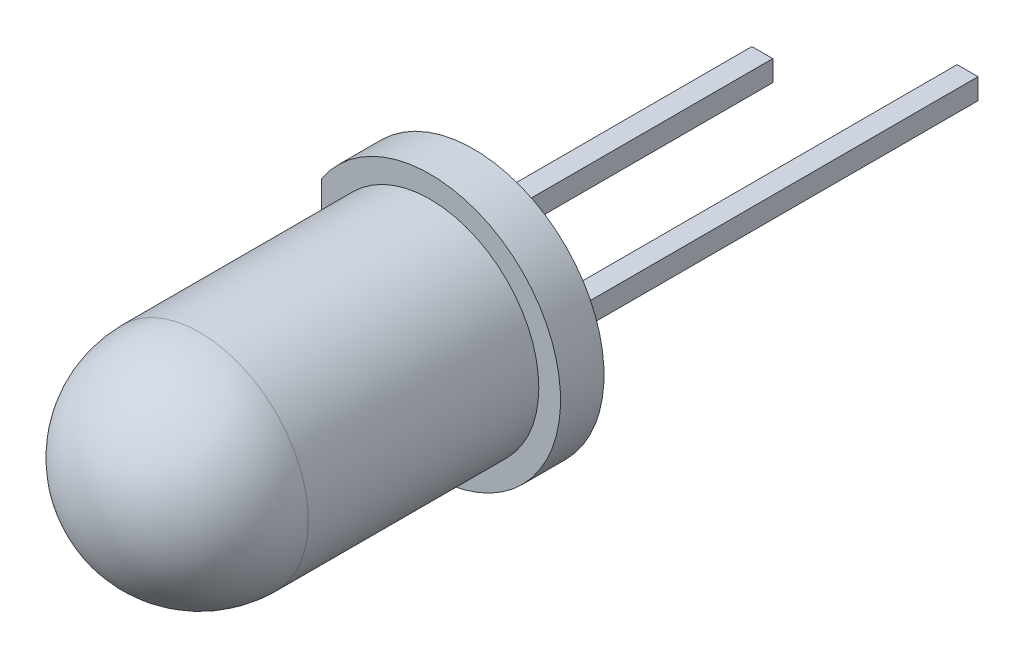
ISO-10303-21;
HEADER;
FILE_DESCRIPTION(('STEP AP214'),'2;1');
FILE_NAME('part.step','',(''),(''),'','','');
FILE_SCHEMA(('AUTOMOTIVE_DESIGN { 1 0 10303 214 1 1 1 1 }'));
ENDSEC;
DATA;
#1=APPLICATION_CONTEXT('core data for automotive mechanical design processes');
#2=APPLICATION_PROTOCOL_DEFINITION('international standard','automotive_design',2000,#1);
#3=PRODUCT_CONTEXT('',#1,'mechanical');
#4=PRODUCT('Part','Part','',(#3));
#5=PRODUCT_RELATED_PRODUCT_CATEGORY('part','',(#4));
#6=PRODUCT_DEFINITION_FORMATION('','',#4);
#7=PRODUCT_DEFINITION_CONTEXT('part definition',#1,'design');
#8=PRODUCT_DEFINITION('design','',#6,#7);
#9=PRODUCT_DEFINITION_SHAPE('','',#8);
#10=(LENGTH_UNIT() NAMED_UNIT(*) SI_UNIT(.MILLI.,.METRE.));
#11=(NAMED_UNIT(*) PLANE_ANGLE_UNIT() SI_UNIT($,.RADIAN.));
#12=(NAMED_UNIT(*) SI_UNIT($,.STERADIAN.) SOLID_ANGLE_UNIT());
#13=UNCERTAINTY_MEASURE_WITH_UNIT(LENGTH_MEASURE(1.E-05),#10,'distance_accuracy_value','');
#14=(GEOMETRIC_REPRESENTATION_CONTEXT(3) GLOBAL_UNCERTAINTY_ASSIGNED_CONTEXT((#13)) GLOBAL_UNIT_ASSIGNED_CONTEXT((#10,
#11,#12)) REPRESENTATION_CONTEXT('',''));
#15=CARTESIAN_POINT('',(0.,0.,0.));
#16=DIRECTION('',(0.,0.,1.));
#17=DIRECTION('',(1.,0.,0.));
#18=AXIS2_PLACEMENT_3D('',#15,#16,#17);
#19=CARTESIAN_POINT('',(-0.0499999999999997,0.,4.26666666666667));
#20=DIRECTION('',(0.,0.,1.));
#21=DIRECTION('',(-1.,0.,0.));
#22=AXIS2_PLACEMENT_3D('',#19,#20,#21);
#23=SPHERICAL_SURFACE('',#22,0.566666666666667);
#24=CARTESIAN_POINT('',(-0.0499999999999997,-0.24,4.26666666666667));
#25=DIRECTION('',(0.,1.,0.));
#26=DIRECTION('',(0.,0.,1.));
#27=AXIS2_PLACEMENT_3D('',#24,#25,#26);
#28=CIRCLE('',#27,0.513333333333333);
#29=CARTESIAN_POINT('',(-0.488634243989226,-0.24,4.));
#30=VERTEX_POINT('',#29);
#31=CARTESIAN_POINT('',(0.388634243989226,-0.24,4.));
#32=VERTEX_POINT('',#31);
#33=EDGE_CURVE('E167',#30,#32,#28,.F.);
#34=ORIENTED_EDGE('',*,*,#33,.T.);
#35=CARTESIAN_POINT('',(-0.0499999999999997,0.,4.));
#36=DIRECTION('',(0.,0.,1.));
#37=DIRECTION('',(1.,0.,0.));
#38=AXIS2_PLACEMENT_3D('',#35,#36,#37);
#39=CIRCLE('',#38,0.5);
#40=EDGE_CURVE('E62',#30,#32,#39,.T.);
#41=ORIENTED_EDGE('',*,*,#40,.F.);
#42=EDGE_LOOP('',(#34,#41));
#43=FACE_BOUND('',#42,.T.);
#44=ADVANCED_FACE('F54',(#43),#23,.T.);
#45=CARTESIAN_POINT('',(0.388634243989226,0.24,4.));
#46=VERTEX_POINT('',#45);
#47=CARTESIAN_POINT('',(-0.488634243989226,0.24,4.));
#48=VERTEX_POINT('',#47);
#49=EDGE_CURVE('E12',#46,#48,#39,.T.);
#50=ORIENTED_EDGE('',*,*,#49,.F.);
#51=CARTESIAN_POINT('',(-0.0499999999999997,0.24,4.26666666666667));
#52=DIRECTION('',(0.,1.,0.));
#53=DIRECTION('',(0.,0.,1.));
#54=AXIS2_PLACEMENT_3D('',#51,#52,#53);
#55=CIRCLE('',#54,0.513333333333333);
#56=EDGE_CURVE('E189',#48,#46,#55,.F.);
#57=ORIENTED_EDGE('',*,*,#56,.F.);
#58=EDGE_LOOP('',(#50,#57));
#59=FACE_BOUND('',#58,.T.);
#60=ADVANCED_FACE('F56',(#59),#23,.T.);
#61=CARTESIAN_POINT('',(-0.55,0.,4.));
#62=DIRECTION('',(0.,0.,-1.));
#63=DIRECTION('',(-1.,0.,0.));
#64=AXIS2_PLACEMENT_3D('',#61,#62,#63);
#65=PLANE('',#64);
#66=CARTESIAN_POINT('',(-0.0499999999999997,0.,4.));
#67=DIRECTION('',(0.,0.,1.));
#68=DIRECTION('',(1.,0.,0.));
#69=AXIS2_PLACEMENT_3D('',#66,#67,#68);
#70=CIRCLE('',#69,0.2);
#71=CARTESIAN_POINT('',(0.15,0.,4.));
#72=VERTEX_POINT('',#71);
#73=EDGE_CURVE('E262',#72,#72,#70,.T.);
#74=ORIENTED_EDGE('',*,*,#73,.F.);
#75=EDGE_LOOP('',(#74));
#76=FACE_BOUND('',#75,.T.);
#77=ORIENTED_EDGE('',*,*,#49,.T.);
#78=DIRECTION('',(1.,0.,0.));
#79=VECTOR('',#78,1.);
#80=CARTESIAN_POINT('',(-1.3,0.24,4.));
#81=LINE('',#80,#79);
#82=CARTESIAN_POINT('',(-1.3,0.24,4.));
#83=VERTEX_POINT('',#82);
#84=EDGE_CURVE('E108',#83,#48,#81,.T.);
#85=ORIENTED_EDGE('',*,*,#84,.F.);
#86=DIRECTION('',(0.,-1.,0.));
#87=VECTOR('',#86,1.);
#88=CARTESIAN_POINT('',(-1.3,0.24,4.));
#89=LINE('',#88,#87);
#90=CARTESIAN_POINT('',(-1.3,-0.24,4.));
#91=VERTEX_POINT('',#90);
#92=EDGE_CURVE('E166',#83,#91,#89,.T.);
#93=ORIENTED_EDGE('',*,*,#92,.T.);
#94=DIRECTION('',(1.,0.,0.));
#95=VECTOR('',#94,1.);
#96=CARTESIAN_POINT('',(-1.3,-0.24,4.));
#97=LINE('',#96,#95);
#98=EDGE_CURVE('E69',#91,#30,#97,.T.);
#99=ORIENTED_EDGE('',*,*,#98,.T.);
#100=ORIENTED_EDGE('',*,*,#40,.T.);
#101=CARTESIAN_POINT('',(1.2,-0.24,4.));
#102=VERTEX_POINT('',#101);
#103=EDGE_CURVE('E152',#32,#102,#97,.T.);
#104=ORIENTED_EDGE('',*,*,#103,.T.);
#105=DIRECTION('',(0.,-1.,0.));
#106=VECTOR('',#105,1.);
#107=CARTESIAN_POINT('',(1.2,0.24,4.));
#108=LINE('',#107,#106);
#109=CARTESIAN_POINT('',(1.2,0.24,4.));
#110=VERTEX_POINT('',#109);
#111=EDGE_CURVE('E136',#110,#102,#108,.T.);
#112=ORIENTED_EDGE('',*,*,#111,.F.);
#113=EDGE_CURVE('E124',#46,#110,#81,.T.);
#114=ORIENTED_EDGE('',*,*,#113,.F.);
#115=EDGE_LOOP('',(#77,#85,#93,#99,#100,#104,#112,#114));
#116=FACE_BOUND('',#115,.T.);
#117=ADVANCED_FACE('F172',(#76,#116),#65,.F.);
#118=CARTESIAN_POINT('',(0.,0.24,0.));
#119=DIRECTION('',(0.,1.,0.));
#120=DIRECTION('',(0.,0.,1.));
#121=AXIS2_PLACEMENT_3D('',#118,#119,#120);
#122=PLANE('',#121);
#123=ORIENTED_EDGE('',*,*,#84,.T.);
#124=ORIENTED_EDGE('',*,*,#56,.T.);
#125=ORIENTED_EDGE('',*,*,#113,.T.);
#126=DIRECTION('',(-0.508148861978286,0.,-0.861269257590315));
#127=VECTOR('',#126,1.);
#128=CARTESIAN_POINT('',(1.2,0.24,4.));
#129=LINE('',#128,#127);
#130=CARTESIAN_POINT('',(0.0199999999999998,0.24,2.));
#131=VERTEX_POINT('',#130);
#132=EDGE_CURVE('E115',#110,#131,#129,.T.);
#133=ORIENTED_EDGE('',*,*,#132,.T.);
#134=DIRECTION('',(-1.,0.,0.));
#135=VECTOR('',#134,1.);
#136=CARTESIAN_POINT('',(0.0199999999999998,0.24,2.));
#137=LINE('',#136,#135);
#138=CARTESIAN_POINT('',(-1.12,0.24,2.));
#139=VERTEX_POINT('',#138);
#140=EDGE_CURVE('E120',#131,#139,#137,.T.);
#141=ORIENTED_EDGE('',*,*,#140,.T.);
#142=DIRECTION('',(0.,0.,-1.));
#143=VECTOR('',#142,1.);
#144=CARTESIAN_POINT('',(-1.12,0.24,2.));
#145=LINE('',#144,#143);
#146=CARTESIAN_POINT('',(-1.12,0.24,-8.));
#147=VERTEX_POINT('',#146);
#148=EDGE_CURVE('E142',#139,#147,#145,.T.);
#149=ORIENTED_EDGE('',*,*,#148,.T.);
#150=DIRECTION('',(1.,0.,0.));
#151=VECTOR('',#150,1.);
#152=CARTESIAN_POINT('',(-1.12,0.24,-8.));
#153=LINE('',#152,#151);
#154=CARTESIAN_POINT('',(-1.6,0.24,-8.));
#155=VERTEX_POINT('',#154);
#156=EDGE_CURVE('E153',#155,#147,#153,.T.);
#157=ORIENTED_EDGE('',*,*,#156,.F.);
#158=DIRECTION('',(0.,0.,1.));
#159=VECTOR('',#158,1.);
#160=CARTESIAN_POINT('',(-1.6,0.24,0.));
#161=LINE('',#160,#159);
#162=CARTESIAN_POINT('',(-1.6,0.24,3.5));
#163=VERTEX_POINT('',#162);
#164=EDGE_CURVE('E78',#155,#163,#161,.T.);
#165=ORIENTED_EDGE('',*,*,#164,.T.);
#166=DIRECTION('',(0.514495755427526,0.,0.857492925712544));
#167=VECTOR('',#166,1.);
#168=CARTESIAN_POINT('',(-1.6,0.24,3.5));
#169=LINE('',#168,#167);
#170=EDGE_CURVE('E162',#163,#83,#169,.T.);
#171=ORIENTED_EDGE('',*,*,#170,.T.);
#172=EDGE_LOOP('',(#123,#124,#125,#133,#141,#149,#157,#165,#171));
#173=FACE_BOUND('',#172,.T.);
#174=ADVANCED_FACE('F117',(#173),#122,.T.);
#175=CARTESIAN_POINT('',(0.,-0.24,0.));
#176=DIRECTION('',(0.,1.,0.));
#177=DIRECTION('',(0.,0.,1.));
#178=AXIS2_PLACEMENT_3D('',#175,#176,#177);
#179=PLANE('',#178);
#180=ORIENTED_EDGE('',*,*,#33,.F.);
#181=ORIENTED_EDGE('',*,*,#98,.F.);
#182=DIRECTION('',(0.514495755427526,0.,0.857492925712544));
#183=VECTOR('',#182,1.);
#184=CARTESIAN_POINT('',(-1.6,-0.24,3.5));
#185=LINE('',#184,#183);
#186=CARTESIAN_POINT('',(-1.6,-0.24,3.5));
#187=VERTEX_POINT('',#186);
#188=EDGE_CURVE('E149',#187,#91,#185,.T.);
#189=ORIENTED_EDGE('',*,*,#188,.F.);
#190=DIRECTION('',(0.,0.,1.));
#191=VECTOR('',#190,1.);
#192=CARTESIAN_POINT('',(-1.6,-0.24,0.));
#193=LINE('',#192,#191);
#194=CARTESIAN_POINT('',(-1.6,-0.24,-8.));
#195=VERTEX_POINT('',#194);
#196=EDGE_CURVE('E102',#195,#187,#193,.T.);
#197=ORIENTED_EDGE('',*,*,#196,.F.);
#198=DIRECTION('',(-1.,0.,0.));
#199=VECTOR('',#198,1.);
#200=CARTESIAN_POINT('',(-1.12,-0.24,-8.));
#201=LINE('',#200,#199);
#202=CARTESIAN_POINT('',(-1.12,-0.24,-8.));
#203=VERTEX_POINT('',#202);
#204=EDGE_CURVE('E210',#203,#195,#201,.T.);
#205=ORIENTED_EDGE('',*,*,#204,.F.);
#206=DIRECTION('',(0.,0.,-1.));
#207=VECTOR('',#206,1.);
#208=CARTESIAN_POINT('',(-1.12,-0.24,2.));
#209=LINE('',#208,#207);
#210=CARTESIAN_POINT('',(-1.12,-0.24,2.));
#211=VERTEX_POINT('',#210);
#212=EDGE_CURVE('E158',#211,#203,#209,.T.);
#213=ORIENTED_EDGE('',*,*,#212,.F.);
#214=DIRECTION('',(-1.,0.,0.));
#215=VECTOR('',#214,1.);
#216=CARTESIAN_POINT('',(0.0199999999999998,-0.24,2.));
#217=LINE('',#216,#215);
#218=CARTESIAN_POINT('',(0.0199999999999998,-0.24,2.));
#219=VERTEX_POINT('',#218);
#220=EDGE_CURVE('E156',#219,#211,#217,.T.);
#221=ORIENTED_EDGE('',*,*,#220,.F.);
#222=DIRECTION('',(-0.508148861978286,0.,-0.861269257590315));
#223=VECTOR('',#222,1.);
#224=CARTESIAN_POINT('',(1.2,-0.24,4.));
#225=LINE('',#224,#223);
#226=EDGE_CURVE('E133',#102,#219,#225,.T.);
#227=ORIENTED_EDGE('',*,*,#226,.F.);
#228=ORIENTED_EDGE('',*,*,#103,.F.);
#229=EDGE_LOOP('',(#180,#181,#189,#197,#205,#213,#221,#227,#228));
#230=FACE_BOUND('',#229,.T.);
#231=ADVANCED_FACE('F224',(#230),#179,.F.);
#232=CARTESIAN_POINT('',(-1.6,0.24,3.5));
#233=DIRECTION('',(0.857492925712544,0.,-0.514495755427526));
#234=DIRECTION('',(-0.514495755427526,0.,-0.857492925712544));
#235=AXIS2_PLACEMENT_3D('',#232,#233,#234);
#236=PLANE('',#235);
#237=ORIENTED_EDGE('',*,*,#188,.T.);
#238=ORIENTED_EDGE('',*,*,#92,.F.);
#239=ORIENTED_EDGE('',*,*,#170,.F.);
#240=DIRECTION('',(0.,-1.,0.));
#241=VECTOR('',#240,1.);
#242=CARTESIAN_POINT('',(-1.6,0.24,3.5));
#243=LINE('',#242,#241);
#244=EDGE_CURVE('E148',#163,#187,#243,.T.);
#245=ORIENTED_EDGE('',*,*,#244,.T.);
#246=EDGE_LOOP('',(#237,#238,#239,#245));
#247=FACE_BOUND('',#246,.T.);
#248=ADVANCED_FACE('F221',(#247),#236,.F.);
#249=CARTESIAN_POINT('',(1.2,0.24,4.));
#250=DIRECTION('',(-0.861269257590315,0.,0.508148861978286));
#251=DIRECTION('',(0.508148861978286,0.,0.861269257590315));
#252=AXIS2_PLACEMENT_3D('',#249,#250,#251);
#253=PLANE('',#252);
#254=ORIENTED_EDGE('',*,*,#226,.T.);
#255=DIRECTION('',(0.,-1.,0.));
#256=VECTOR('',#255,1.);
#257=CARTESIAN_POINT('',(0.0199999999999998,0.24,2.));
#258=LINE('',#257,#256);
#259=EDGE_CURVE('E130',#131,#219,#258,.T.);
#260=ORIENTED_EDGE('',*,*,#259,.F.);
#261=ORIENTED_EDGE('',*,*,#132,.F.);
#262=ORIENTED_EDGE('',*,*,#111,.T.);
#263=EDGE_LOOP('',(#254,#260,#261,#262));
#264=FACE_BOUND('',#263,.T.);
#265=ADVANCED_FACE('F131',(#264),#253,.F.);
#266=CARTESIAN_POINT('',(0.0199999999999998,0.24,2.));
#267=DIRECTION('',(0.,0.,1.));
#268=DIRECTION('',(1.,0.,0.));
#269=AXIS2_PLACEMENT_3D('',#266,#267,#268);
#270=PLANE('',#269);
#271=ORIENTED_EDGE('',*,*,#220,.T.);
#272=DIRECTION('',(0.,-1.,0.));
#273=VECTOR('',#272,1.);
#274=CARTESIAN_POINT('',(-1.12,0.24,2.));
#275=LINE('',#274,#273);
#276=EDGE_CURVE('E137',#139,#211,#275,.T.);
#277=ORIENTED_EDGE('',*,*,#276,.F.);
#278=ORIENTED_EDGE('',*,*,#140,.F.);
#279=ORIENTED_EDGE('',*,*,#259,.T.);
#280=EDGE_LOOP('',(#271,#277,#278,#279));
#281=FACE_BOUND('',#280,.T.);
#282=ADVANCED_FACE('F139',(#281),#270,.F.);
#283=CARTESIAN_POINT('',(-1.12,0.24,2.));
#284=DIRECTION('',(-1.,0.,0.));
#285=DIRECTION('',(0.,0.,1.));
#286=AXIS2_PLACEMENT_3D('',#283,#284,#285);
#287=PLANE('',#286);
#288=ORIENTED_EDGE('',*,*,#212,.T.);
#289=DIRECTION('',(0.,-1.,0.));
#290=VECTOR('',#289,1.);
#291=CARTESIAN_POINT('',(-1.12,-0.24,-8.));
#292=LINE('',#291,#290);
#293=EDGE_CURVE('E204',#147,#203,#292,.T.);
#294=ORIENTED_EDGE('',*,*,#293,.F.);
#295=ORIENTED_EDGE('',*,*,#148,.F.);
#296=ORIENTED_EDGE('',*,*,#276,.T.);
#297=EDGE_LOOP('',(#288,#294,#295,#296));
#298=FACE_BOUND('',#297,.T.);
#299=ADVANCED_FACE('F207',(#298),#287,.F.);
#300=CARTESIAN_POINT('',(-1.6,0.24,0.));
#301=DIRECTION('',(1.,0.,0.));
#302=DIRECTION('',(0.,0.,-1.));
#303=AXIS2_PLACEMENT_3D('',#300,#301,#302);
#304=PLANE('',#303);
#305=ORIENTED_EDGE('',*,*,#196,.T.);
#306=ORIENTED_EDGE('',*,*,#244,.F.);
#307=ORIENTED_EDGE('',*,*,#164,.F.);
#308=DIRECTION('',(0.,1.,0.));
#309=VECTOR('',#308,1.);
#310=CARTESIAN_POINT('',(-1.6,-0.24,-8.));
#311=LINE('',#310,#309);
#312=EDGE_CURVE('E205',#195,#155,#311,.T.);
#313=ORIENTED_EDGE('',*,*,#312,.F.);
#314=EDGE_LOOP('',(#305,#306,#307,#313));
#315=FACE_BOUND('',#314,.T.);
#316=ADVANCED_FACE('F225',(#315),#304,.F.);
#317=CARTESIAN_POINT('',(0.,0.,-8.));
#318=DIRECTION('',(0.,0.,1.));
#319=DIRECTION('',(1.,0.,0.));
#320=AXIS2_PLACEMENT_3D('',#317,#318,#319);
#321=PLANE('',#320);
#322=ORIENTED_EDGE('',*,*,#293,.T.);
#323=ORIENTED_EDGE('',*,*,#204,.T.);
#324=ORIENTED_EDGE('',*,*,#312,.T.);
#325=ORIENTED_EDGE('',*,*,#156,.T.);
#326=EDGE_LOOP('',(#322,#323,#324,#325));
#327=FACE_BOUND('',#326,.T.);
#328=ADVANCED_FACE('F202',(#327),#321,.F.);
#329=CARTESIAN_POINT('',(-0.0499999999999997,0.,3.9));
#330=DIRECTION('',(0.,0.,1.));
#331=DIRECTION('',(1.,0.,0.));
#332=AXIS2_PLACEMENT_3D('',#329,#330,#331);
#333=CYLINDRICAL_SURFACE('',#332,0.2);
#334=CARTESIAN_POINT('',(-0.0499999999999997,0.,3.9));
#335=DIRECTION('',(0.,0.,1.));
#336=DIRECTION('',(1.,0.,0.));
#337=AXIS2_PLACEMENT_3D('',#334,#335,#336);
#338=CIRCLE('',#337,0.2);
#339=CARTESIAN_POINT('',(0.15,0.,3.9));
#340=VERTEX_POINT('',#339);
#341=EDGE_CURVE('E213',#340,#340,#338,.T.);
#342=ORIENTED_EDGE('',*,*,#341,.F.);
#343=EDGE_LOOP('',(#342));
#344=FACE_BOUND('',#343,.T.);
#345=ORIENTED_EDGE('',*,*,#73,.T.);
#346=EDGE_LOOP('',(#345));
#347=FACE_BOUND('',#346,.T.);
#348=ADVANCED_FACE('F232',(#344,#347),#333,.F.);
#349=CARTESIAN_POINT('',(-0.0499999999999997,0.,3.9));
#350=DIRECTION('',(0.,0.,1.));
#351=DIRECTION('',(1.,0.,0.));
#352=AXIS2_PLACEMENT_3D('',#349,#350,#351);
#353=PLANE('',#352);
#354=ORIENTED_EDGE('',*,*,#341,.T.);
#355=EDGE_LOOP('',(#354));
#356=FACE_BOUND('',#355,.T.);
#357=ADVANCED_FACE('F254',(#356),#353,.T.);
#358=CLOSED_SHELL('',(#44,#60,#117,#174,#231,#248,#265,#282,#299,#316,#328,#348,#357));
#359=MANIFOLD_SOLID_BREP('B2',#358);
#360=CARTESIAN_POINT('',(1.12,0.24,2.));
#361=DIRECTION('',(0.,0.,1.));
#362=DIRECTION('',(1.,0.,0.));
#363=AXIS2_PLACEMENT_3D('',#360,#361,#362);
#364=PLANE('',#363);
#365=DIRECTION('',(-1.,0.,0.));
#366=VECTOR('',#365,1.);
#367=CARTESIAN_POINT('',(1.12,-0.24,2.));
#368=LINE('',#367,#366);
#369=CARTESIAN_POINT('',(1.12,-0.24,2.));
#370=VERTEX_POINT('',#369);
#371=CARTESIAN_POINT('',(0.22,-0.24,2.));
#372=VERTEX_POINT('',#371);
#373=EDGE_CURVE('E460',#370,#372,#368,.T.);
#374=ORIENTED_EDGE('',*,*,#373,.T.);
#375=DIRECTION('',(0.,-1.,0.));
#376=VECTOR('',#375,1.);
#377=CARTESIAN_POINT('',(0.22,0.24,2.));
#378=LINE('',#377,#376);
#379=CARTESIAN_POINT('',(0.22,0.24,2.));
#380=VERTEX_POINT('',#379);
#381=EDGE_CURVE('E52',#380,#372,#378,.T.);
#382=ORIENTED_EDGE('',*,*,#381,.F.);
#383=DIRECTION('',(-1.,0.,0.));
#384=VECTOR('',#383,1.);
#385=CARTESIAN_POINT('',(1.12,0.24,2.));
#386=LINE('',#385,#384);
#387=CARTESIAN_POINT('',(1.12,0.24,2.));
#388=VERTEX_POINT('',#387);
#389=EDGE_CURVE('E461',#388,#380,#386,.T.);
#390=ORIENTED_EDGE('',*,*,#389,.F.);
#391=DIRECTION('',(0.,-1.,0.));
#392=VECTOR('',#391,1.);
#393=CARTESIAN_POINT('',(1.12,0.24,2.));
#394=LINE('',#393,#392);
#395=EDGE_CURVE('E466',#388,#370,#394,.T.);
#396=ORIENTED_EDGE('',*,*,#395,.T.);
#397=EDGE_LOOP('',(#374,#382,#390,#396));
#398=FACE_BOUND('',#397,.T.);
#399=ADVANCED_FACE('F374',(#398),#364,.F.);
#400=CARTESIAN_POINT('',(0.22,0.24,2.));
#401=DIRECTION('',(0.861269257590315,0.,-0.508148861978286));
#402=DIRECTION('',(-0.508148861978286,0.,-0.861269257590315));
#403=AXIS2_PLACEMENT_3D('',#400,#401,#402);
#404=PLANE('',#403);
#405=DIRECTION('',(0.508148861978286,0.,0.861269257590315));
#406=VECTOR('',#405,1.);
#407=CARTESIAN_POINT('',(0.22,-0.24,2.));
#408=LINE('',#407,#406);
#409=CARTESIAN_POINT('',(1.4,-0.24,4.));
#410=VERTEX_POINT('',#409);
#411=EDGE_CURVE('E469',#372,#410,#408,.T.);
#412=ORIENTED_EDGE('',*,*,#411,.T.);
#413=DIRECTION('',(0.,-1.,0.));
#414=VECTOR('',#413,1.);
#415=CARTESIAN_POINT('',(1.4,0.24,4.));
#416=LINE('',#415,#414);
#417=CARTESIAN_POINT('',(1.4,0.24,4.));
#418=VERTEX_POINT('',#417);
#419=EDGE_CURVE('E382',#418,#410,#416,.T.);
#420=ORIENTED_EDGE('',*,*,#419,.F.);
#421=DIRECTION('',(0.508148861978286,0.,0.861269257590315));
#422=VECTOR('',#421,1.);
#423=CARTESIAN_POINT('',(0.22,0.24,2.));
#424=LINE('',#423,#422);
#425=EDGE_CURVE('E423',#380,#418,#424,.T.);
#426=ORIENTED_EDGE('',*,*,#425,.F.);
#427=ORIENTED_EDGE('',*,*,#381,.T.);
#428=EDGE_LOOP('',(#412,#420,#426,#427));
#429=FACE_BOUND('',#428,.T.);
#430=ADVANCED_FACE('F484',(#429),#404,.F.);
#431=CARTESIAN_POINT('',(1.4,0.24,4.));
#432=DIRECTION('',(0.,0.,-1.));
#433=DIRECTION('',(-1.,0.,0.));
#434=AXIS2_PLACEMENT_3D('',#431,#432,#433);
#435=PLANE('',#434);
#436=DIRECTION('',(1.,0.,0.));
#437=VECTOR('',#436,1.);
#438=CARTESIAN_POINT('',(1.4,-0.24,4.));
#439=LINE('',#438,#437);
#440=CARTESIAN_POINT('',(1.6,-0.24,4.));
#441=VERTEX_POINT('',#440);
#442=EDGE_CURVE('E409',#410,#441,#439,.T.);
#443=ORIENTED_EDGE('',*,*,#442,.T.);
#444=DIRECTION('',(0.,-1.,0.));
#445=VECTOR('',#444,1.);
#446=CARTESIAN_POINT('',(1.6,0.24,4.));
#447=LINE('',#446,#445);
#448=CARTESIAN_POINT('',(1.6,0.24,4.));
#449=VERTEX_POINT('',#448);
#450=EDGE_CURVE('E475',#449,#441,#447,.T.);
#451=ORIENTED_EDGE('',*,*,#450,.F.);
#452=DIRECTION('',(1.,0.,0.));
#453=VECTOR('',#452,1.);
#454=CARTESIAN_POINT('',(1.4,0.24,4.));
#455=LINE('',#454,#453);
#456=EDGE_CURVE('E440',#418,#449,#455,.T.);
#457=ORIENTED_EDGE('',*,*,#456,.F.);
#458=ORIENTED_EDGE('',*,*,#419,.T.);
#459=EDGE_LOOP('',(#443,#451,#457,#458));
#460=FACE_BOUND('',#459,.T.);
#461=ADVANCED_FACE('F476',(#460),#435,.F.);
#462=CARTESIAN_POINT('',(1.6,0.24,4.));
#463=DIRECTION('',(-1.,0.,0.));
#464=DIRECTION('',(0.,0.,1.));
#465=AXIS2_PLACEMENT_3D('',#462,#463,#464);
#466=PLANE('',#465);
#467=DIRECTION('',(0.,0.,-1.));
#468=VECTOR('',#467,1.);
#469=CARTESIAN_POINT('',(1.6,-0.24,4.));
#470=LINE('',#469,#468);
#471=CARTESIAN_POINT('',(1.6,-0.24,-10.));
#472=VERTEX_POINT('',#471);
#473=EDGE_CURVE('E447',#441,#472,#470,.T.);
#474=ORIENTED_EDGE('',*,*,#473,.T.);
#475=DIRECTION('',(0.,-1.,0.));
#476=VECTOR('',#475,1.);
#477=CARTESIAN_POINT('',(1.6,0.24,-10.));
#478=LINE('',#477,#476);
#479=CARTESIAN_POINT('',(1.6,0.24,-10.));
#480=VERTEX_POINT('',#479);
#481=EDGE_CURVE('E444',#480,#472,#478,.T.);
#482=ORIENTED_EDGE('',*,*,#481,.F.);
#483=DIRECTION('',(0.,0.,-1.));
#484=VECTOR('',#483,1.);
#485=CARTESIAN_POINT('',(1.6,0.24,4.));
#486=LINE('',#485,#484);
#487=EDGE_CURVE('E434',#449,#480,#486,.T.);
#488=ORIENTED_EDGE('',*,*,#487,.F.);
#489=ORIENTED_EDGE('',*,*,#450,.T.);
#490=EDGE_LOOP('',(#474,#482,#488,#489));
#491=FACE_BOUND('',#490,.T.);
#492=ADVANCED_FACE('F445',(#491),#466,.F.);
#493=CARTESIAN_POINT('',(1.12,0.24,0.));
#494=DIRECTION('',(1.,0.,0.));
#495=DIRECTION('',(0.,0.,-1.));
#496=AXIS2_PLACEMENT_3D('',#493,#494,#495);
#497=PLANE('',#496);
#498=DIRECTION('',(0.,0.,1.));
#499=VECTOR('',#498,1.);
#500=CARTESIAN_POINT('',(1.12,-0.24,0.));
#501=LINE('',#500,#499);
#502=CARTESIAN_POINT('',(1.12,-0.24,-10.));
#503=VERTEX_POINT('',#502);
#504=EDGE_CURVE('E416',#503,#370,#501,.T.);
#505=ORIENTED_EDGE('',*,*,#504,.T.);
#506=ORIENTED_EDGE('',*,*,#395,.F.);
#507=DIRECTION('',(0.,0.,1.));
#508=VECTOR('',#507,1.);
#509=CARTESIAN_POINT('',(1.12,0.24,0.));
#510=LINE('',#509,#508);
#511=CARTESIAN_POINT('',(1.12,0.24,-10.));
#512=VERTEX_POINT('',#511);
#513=EDGE_CURVE('E390',#512,#388,#510,.T.);
#514=ORIENTED_EDGE('',*,*,#513,.F.);
#515=DIRECTION('',(0.,1.,0.));
#516=VECTOR('',#515,1.);
#517=CARTESIAN_POINT('',(1.12,-0.24,-10.));
#518=LINE('',#517,#516);
#519=EDGE_CURVE('E455',#503,#512,#518,.T.);
#520=ORIENTED_EDGE('',*,*,#519,.F.);
#521=EDGE_LOOP('',(#505,#506,#514,#520));
#522=FACE_BOUND('',#521,.T.);
#523=ADVANCED_FACE('F480',(#522),#497,.F.);
#524=CARTESIAN_POINT('',(0.,0.24,0.));
#525=DIRECTION('',(0.,-1.,0.));
#526=DIRECTION('',(0.,0.,-1.));
#527=AXIS2_PLACEMENT_3D('',#524,#525,#526);
#528=PLANE('',#527);
#529=ORIENTED_EDGE('',*,*,#389,.T.);
#530=ORIENTED_EDGE('',*,*,#425,.T.);
#531=ORIENTED_EDGE('',*,*,#456,.T.);
#532=ORIENTED_EDGE('',*,*,#487,.T.);
#533=DIRECTION('',(1.,0.,0.));
#534=VECTOR('',#533,1.);
#535=CARTESIAN_POINT('',(1.12,0.24,-10.));
#536=LINE('',#535,#534);
#537=EDGE_CURVE('E438',#512,#480,#536,.T.);
#538=ORIENTED_EDGE('',*,*,#537,.F.);
#539=ORIENTED_EDGE('',*,*,#513,.T.);
#540=EDGE_LOOP('',(#529,#530,#531,#532,#538,#539));
#541=FACE_BOUND('',#540,.T.);
#542=ADVANCED_FACE('F436',(#541),#528,.F.);
#543=CARTESIAN_POINT('',(0.,-0.24,0.));
#544=DIRECTION('',(0.,-1.,0.));
#545=DIRECTION('',(0.,0.,-1.));
#546=AXIS2_PLACEMENT_3D('',#543,#544,#545);
#547=PLANE('',#546);
#548=ORIENTED_EDGE('',*,*,#373,.F.);
#549=ORIENTED_EDGE('',*,*,#504,.F.);
#550=DIRECTION('',(-1.,0.,0.));
#551=VECTOR('',#550,1.);
#552=CARTESIAN_POINT('',(1.6,-0.24,-10.));
#553=LINE('',#552,#551);
#554=EDGE_CURVE('E451',#472,#503,#553,.T.);
#555=ORIENTED_EDGE('',*,*,#554,.F.);
#556=ORIENTED_EDGE('',*,*,#473,.F.);
#557=ORIENTED_EDGE('',*,*,#442,.F.);
#558=ORIENTED_EDGE('',*,*,#411,.F.);
#559=EDGE_LOOP('',(#548,#549,#555,#556,#557,#558));
#560=FACE_BOUND('',#559,.T.);
#561=ADVANCED_FACE('F479',(#560),#547,.T.);
#562=CARTESIAN_POINT('',(0.,0.,-10.));
#563=DIRECTION('',(0.,0.,-1.));
#564=DIRECTION('',(-1.,0.,0.));
#565=AXIS2_PLACEMENT_3D('',#562,#563,#564);
#566=PLANE('',#565);
#567=ORIENTED_EDGE('',*,*,#537,.T.);
#568=ORIENTED_EDGE('',*,*,#481,.T.);
#569=ORIENTED_EDGE('',*,*,#554,.T.);
#570=ORIENTED_EDGE('',*,*,#519,.T.);
#571=EDGE_LOOP('',(#567,#568,#569,#570));
#572=FACE_BOUND('',#571,.T.);
#573=ADVANCED_FACE('F454',(#572),#566,.T.);
#574=CLOSED_SHELL('',(#399,#430,#461,#492,#523,#542,#561,#573));
#575=MANIFOLD_SOLID_BREP('B6',#574);
#576=CARTESIAN_POINT('',(0.,0.,1.));
#577=DIRECTION('',(0.,0.,-1.));
#578=DIRECTION('',(-1.,0.,0.));
#579=AXIS2_PLACEMENT_3D('',#576,#577,#578);
#580=CYLINDRICAL_SURFACE('',#579,3.);
#581=CARTESIAN_POINT('',(0.,0.,1.));
#582=DIRECTION('',(0.,0.,1.));
#583=DIRECTION('',(1.,0.,0.));
#584=AXIS2_PLACEMENT_3D('',#581,#582,#583);
#585=CIRCLE('',#584,3.);
#586=CARTESIAN_POINT('',(-2.5,-1.6583123951777,1.));
#587=VERTEX_POINT('',#586);
#588=CARTESIAN_POINT('',(-2.5,1.6583123951777,1.));
#589=VERTEX_POINT('',#588);
#590=EDGE_CURVE('E587',#587,#589,#585,.T.);
#591=ORIENTED_EDGE('',*,*,#590,.F.);
#592=DIRECTION('',(0.,0.,-1.));
#593=VECTOR('',#592,1.);
#594=CARTESIAN_POINT('',(-2.5,-1.6583123951777,4.35410196624969));
#595=LINE('',#594,#593);
#596=CARTESIAN_POINT('',(-2.5,-1.6583123951777,0.));
#597=VERTEX_POINT('',#596);
#598=EDGE_CURVE('E813',#587,#597,#595,.T.);
#599=ORIENTED_EDGE('',*,*,#598,.T.);
#600=CARTESIAN_POINT('',(0.,0.,0.));
#601=DIRECTION('',(0.,0.,1.));
#602=DIRECTION('',(1.,0.,0.));
#603=AXIS2_PLACEMENT_3D('',#600,#601,#602);
#604=CIRCLE('',#603,3.);
#605=CARTESIAN_POINT('',(-2.5,1.6583123951777,0.));
#606=VERTEX_POINT('',#605);
#607=EDGE_CURVE('E824',#597,#606,#604,.T.);
#608=ORIENTED_EDGE('',*,*,#607,.T.);
#609=DIRECTION('',(0.,0.,-1.));
#610=VECTOR('',#609,1.);
#611=CARTESIAN_POINT('',(-2.5,1.6583123951777,4.35410196624969));
#612=LINE('',#611,#610);
#613=EDGE_CURVE('E817',#589,#606,#612,.T.);
#614=ORIENTED_EDGE('',*,*,#613,.F.);
#615=EDGE_LOOP('',(#591,#599,#608,#614));
#616=FACE_BOUND('',#615,.T.);
#617=ADVANCED_FACE('F579',(#616),#580,.T.);
#618=CARTESIAN_POINT('',(0.,0.,1.));
#619=DIRECTION('',(0.,0.,1.));
#620=DIRECTION('',(1.,0.,0.));
#621=AXIS2_PLACEMENT_3D('',#618,#619,#620);
#622=PLANE('',#621);
#623=DIRECTION('',(0.,-1.,0.));
#624=VECTOR('',#623,1.);
#625=CARTESIAN_POINT('',(-2.5,1.6583123951777,1.));
#626=LINE('',#625,#624);
#627=CARTESIAN_POINT('',(-2.5,0.,1.));
#628=VERTEX_POINT('',#627);
#629=EDGE_CURVE('E808',#628,#587,#626,.T.);
#630=ORIENTED_EDGE('',*,*,#629,.T.);
#631=ORIENTED_EDGE('',*,*,#590,.T.);
#632=EDGE_CURVE('E809',#589,#628,#626,.T.);
#633=ORIENTED_EDGE('',*,*,#632,.T.);
#634=CARTESIAN_POINT('',(0.,0.,1.));
#635=DIRECTION('',(0.,0.,1.));
#636=DIRECTION('',(1.,0.,0.));
#637=AXIS2_PLACEMENT_3D('',#634,#635,#636);
#638=CIRCLE('',#637,2.5);
#639=EDGE_CURVE('E372',#628,#628,#638,.T.);
#640=ORIENTED_EDGE('',*,*,#639,.F.);
#641=EDGE_LOOP('',(#630,#631,#633,#640));
#642=FACE_BOUND('',#641,.T.);
#643=ADVANCED_FACE('F840',(#642),#622,.T.);
#644=CARTESIAN_POINT('',(0.,0.,0.));
#645=DIRECTION('',(0.,0.,1.));
#646=DIRECTION('',(1.,0.,0.));
#647=AXIS2_PLACEMENT_3D('',#644,#645,#646);
#648=PLANE('',#647);
#649=DIRECTION('',(0.,1.,0.));
#650=VECTOR('',#649,1.);
#651=CARTESIAN_POINT('',(1.12,-0.24,0.));
#652=LINE('',#651,#650);
#653=CARTESIAN_POINT('',(1.12,-0.24,0.));
#654=VERTEX_POINT('',#653);
#655=CARTESIAN_POINT('',(1.12,0.24,0.));
#656=VERTEX_POINT('',#655);
#657=EDGE_CURVE('E694',#654,#656,#652,.T.);
#658=ORIENTED_EDGE('',*,*,#657,.F.);
#659=DIRECTION('',(-1.,0.,0.));
#660=VECTOR('',#659,1.);
#661=CARTESIAN_POINT('',(1.12,-0.24,0.));
#662=LINE('',#661,#660);
#663=CARTESIAN_POINT('',(1.6,-0.24,0.));
#664=VERTEX_POINT('',#663);
#665=EDGE_CURVE('E702',#664,#654,#662,.T.);
#666=ORIENTED_EDGE('',*,*,#665,.F.);
#667=DIRECTION('',(0.,1.,0.));
#668=VECTOR('',#667,1.);
#669=CARTESIAN_POINT('',(1.6,-0.24,0.));
#670=LINE('',#669,#668);
#671=CARTESIAN_POINT('',(1.6,0.24,0.));
#672=VERTEX_POINT('',#671);
#673=EDGE_CURVE('E762',#664,#672,#670,.T.);
#674=ORIENTED_EDGE('',*,*,#673,.T.);
#675=DIRECTION('',(-1.,0.,0.));
#676=VECTOR('',#675,1.);
#677=CARTESIAN_POINT('',(1.12,0.24,0.));
#678=LINE('',#677,#676);
#679=EDGE_CURVE('E717',#672,#656,#678,.T.);
#680=ORIENTED_EDGE('',*,*,#679,.T.);
#681=EDGE_LOOP('',(#658,#666,#674,#680));
#682=FACE_BOUND('',#681,.T.);
#683=DIRECTION('',(0.,1.,0.));
#684=VECTOR('',#683,1.);
#685=CARTESIAN_POINT('',(-1.6,-0.24,0.));
#686=LINE('',#685,#684);
#687=CARTESIAN_POINT('',(-1.6,-0.24,0.));
#688=VERTEX_POINT('',#687);
#689=CARTESIAN_POINT('',(-1.6,0.24,0.));
#690=VERTEX_POINT('',#689);
#691=EDGE_CURVE('E757',#688,#690,#686,.T.);
#692=ORIENTED_EDGE('',*,*,#691,.F.);
#693=DIRECTION('',(-1.,0.,0.));
#694=VECTOR('',#693,1.);
#695=CARTESIAN_POINT('',(-1.6,-0.24,0.));
#696=LINE('',#695,#694);
#697=CARTESIAN_POINT('',(-1.12,-0.24,0.));
#698=VERTEX_POINT('',#697);
#699=EDGE_CURVE('E728',#698,#688,#696,.T.);
#700=ORIENTED_EDGE('',*,*,#699,.F.);
#701=DIRECTION('',(0.,1.,0.));
#702=VECTOR('',#701,1.);
#703=CARTESIAN_POINT('',(-1.12,-0.24,0.));
#704=LINE('',#703,#702);
#705=CARTESIAN_POINT('',(-1.12,0.24,0.));
#706=VERTEX_POINT('',#705);
#707=EDGE_CURVE('E784',#698,#706,#704,.T.);
#708=ORIENTED_EDGE('',*,*,#707,.T.);
#709=DIRECTION('',(-1.,0.,0.));
#710=VECTOR('',#709,1.);
#711=CARTESIAN_POINT('',(-1.6,0.24,0.));
#712=LINE('',#711,#710);
#713=EDGE_CURVE('E758',#706,#690,#712,.T.);
#714=ORIENTED_EDGE('',*,*,#713,.T.);
#715=EDGE_LOOP('',(#692,#700,#708,#714));
#716=FACE_BOUND('',#715,.T.);
#717=ORIENTED_EDGE('',*,*,#607,.F.);
#718=DIRECTION('',(0.,-1.,0.));
#719=VECTOR('',#718,1.);
#720=CARTESIAN_POINT('',(-2.5,1.6583123951777,0.));
#721=LINE('',#720,#719);
#722=EDGE_CURVE('E788',#606,#597,#721,.T.);
#723=ORIENTED_EDGE('',*,*,#722,.F.);
#724=EDGE_LOOP('',(#717,#723));
#725=FACE_BOUND('',#724,.T.);
#726=ADVANCED_FACE('F715',(#682,#716,#725),#648,.F.);
#727=CARTESIAN_POINT('',(0.,0.,6.3));
#728=DIRECTION('',(0.,0.,-1.));
#729=DIRECTION('',(0.,1.,0.));
#730=AXIS2_PLACEMENT_3D('',#727,#728,#729);
#731=SPHERICAL_SURFACE('',#730,2.5);
#732=CARTESIAN_POINT('',(0.,0.,6.3));
#733=DIRECTION('',(0.,0.,-1.));
#734=DIRECTION('',(0.,1.,0.));
#735=AXIS2_PLACEMENT_3D('',#732,#733,#734);
#736=CIRCLE('',#735,2.5);
#737=CARTESIAN_POINT('',(0.,2.5,6.3));
#738=VERTEX_POINT('',#737);
#739=EDGE_CURVE('E820',#738,#738,#736,.T.);
#740=ORIENTED_EDGE('',*,*,#739,.F.);
#741=EDGE_LOOP('',(#740));
#742=FACE_BOUND('',#741,.T.);
#743=ADVANCED_FACE('F844',(#742),#731,.T.);
#744=CARTESIAN_POINT('',(0.,0.,1.));
#745=DIRECTION('',(0.,0.,-1.));
#746=DIRECTION('',(0.,1.,0.));
#747=AXIS2_PLACEMENT_3D('',#744,#745,#746);
#748=CYLINDRICAL_SURFACE('',#747,2.5);
#749=ORIENTED_EDGE('',*,*,#739,.T.);
#750=EDGE_LOOP('',(#749));
#751=FACE_BOUND('',#750,.T.);
#752=ORIENTED_EDGE('',*,*,#639,.T.);
#753=EDGE_LOOP('',(#752));
#754=FACE_BOUND('',#753,.T.);
#755=ADVANCED_FACE('F842',(#751,#754),#748,.T.);
#756=CARTESIAN_POINT('',(-2.5,1.6583123951777,4.35410196624969));
#757=DIRECTION('',(1.,0.,0.));
#758=DIRECTION('',(0.,0.,-1.));
#759=AXIS2_PLACEMENT_3D('',#756,#757,#758);
#760=PLANE('',#759);
#761=ORIENTED_EDGE('',*,*,#613,.T.);
#762=ORIENTED_EDGE('',*,*,#722,.T.);
#763=ORIENTED_EDGE('',*,*,#598,.F.);
#764=ORIENTED_EDGE('',*,*,#629,.F.);
#765=ORIENTED_EDGE('',*,*,#632,.F.);
#766=EDGE_LOOP('',(#761,#762,#763,#764,#765));
#767=FACE_BOUND('',#766,.T.);
#768=ADVANCED_FACE('F836',(#767),#760,.F.);
#769=CARTESIAN_POINT('',(-1.12,-0.24,0.));
#770=DIRECTION('',(1.,0.,0.));
#771=DIRECTION('',(0.,0.,-1.));
#772=AXIS2_PLACEMENT_3D('',#769,#770,#771);
#773=PLANE('',#772);
#774=DIRECTION('',(0.,0.,-1.));
#775=VECTOR('',#774,1.);
#776=CARTESIAN_POINT('',(-1.12,0.24,0.));
#777=LINE('',#776,#775);
#778=CARTESIAN_POINT('',(-1.12,0.24,2.));
#779=VERTEX_POINT('',#778);
#780=EDGE_CURVE('E733',#779,#706,#777,.T.);
#781=ORIENTED_EDGE('',*,*,#780,.T.);
#782=ORIENTED_EDGE('',*,*,#707,.F.);
#783=DIRECTION('',(0.,0.,-1.));
#784=VECTOR('',#783,1.);
#785=CARTESIAN_POINT('',(-1.12,-0.24,0.));
#786=LINE('',#785,#784);
#787=CARTESIAN_POINT('',(-1.12,-0.24,2.));
#788=VERTEX_POINT('',#787);
#789=EDGE_CURVE('E753',#788,#698,#786,.T.);
#790=ORIENTED_EDGE('',*,*,#789,.F.);
#791=DIRECTION('',(0.,1.,0.));
#792=VECTOR('',#791,1.);
#793=CARTESIAN_POINT('',(-1.12,-0.24,2.));
#794=LINE('',#793,#792);
#795=EDGE_CURVE('E789',#788,#779,#794,.T.);
#796=ORIENTED_EDGE('',*,*,#795,.T.);
#797=EDGE_LOOP('',(#781,#782,#790,#796));
#798=FACE_BOUND('',#797,.T.);
#799=ADVANCED_FACE('F851',(#798),#773,.F.);
#800=CARTESIAN_POINT('',(-1.12,-0.24,2.));
#801=DIRECTION('',(0.,0.,-1.));
#802=DIRECTION('',(-1.,0.,0.));
#803=AXIS2_PLACEMENT_3D('',#800,#801,#802);
#804=PLANE('',#803);
#805=DIRECTION('',(-1.,0.,0.));
#806=VECTOR('',#805,1.);
#807=CARTESIAN_POINT('',(-1.12,0.24,2.));
#808=LINE('',#807,#806);
#809=CARTESIAN_POINT('',(0.0199999999999998,0.24,2.));
#810=VERTEX_POINT('',#809);
#811=EDGE_CURVE('E777',#810,#779,#808,.T.);
#812=ORIENTED_EDGE('',*,*,#811,.T.);
#813=ORIENTED_EDGE('',*,*,#795,.F.);
#814=DIRECTION('',(-1.,0.,0.));
#815=VECTOR('',#814,1.);
#816=CARTESIAN_POINT('',(-1.12,-0.24,2.));
#817=LINE('',#816,#815);
#818=CARTESIAN_POINT('',(0.0199999999999998,-0.24,2.));
#819=VERTEX_POINT('',#818);
#820=EDGE_CURVE('E749',#819,#788,#817,.T.);
#821=ORIENTED_EDGE('',*,*,#820,.F.);
#822=DIRECTION('',(0.,1.,0.));
#823=VECTOR('',#822,1.);
#824=CARTESIAN_POINT('',(0.0199999999999998,-0.24,2.));
#825=LINE('',#824,#823);
#826=EDGE_CURVE('E792',#819,#810,#825,.T.);
#827=ORIENTED_EDGE('',*,*,#826,.T.);
#828=EDGE_LOOP('',(#812,#813,#821,#827));
#829=FACE_BOUND('',#828,.T.);
#830=ADVANCED_FACE('F899',(#829),#804,.F.);
#831=CARTESIAN_POINT('',(0.0199999999999998,-0.24,2.));
#832=DIRECTION('',(0.861269257590315,0.,-0.508148861978286));
#833=DIRECTION('',(-0.508148861978286,0.,-0.861269257590315));
#834=AXIS2_PLACEMENT_3D('',#831,#832,#833);
#835=PLANE('',#834);
#836=DIRECTION('',(-0.508148861978286,0.,-0.861269257590315));
#837=VECTOR('',#836,1.);
#838=CARTESIAN_POINT('',(0.0199999999999998,0.24,2.));
#839=LINE('',#838,#837);
#840=CARTESIAN_POINT('',(1.2,0.24,4.));
#841=VERTEX_POINT('',#840);
#842=EDGE_CURVE('E773',#841,#810,#839,.T.);
#843=ORIENTED_EDGE('',*,*,#842,.T.);
#844=ORIENTED_EDGE('',*,*,#826,.F.);
#845=DIRECTION('',(-0.508148861978286,0.,-0.861269257590315));
#846=VECTOR('',#845,1.);
#847=CARTESIAN_POINT('',(0.0199999999999998,-0.24,2.));
#848=LINE('',#847,#846);
#849=CARTESIAN_POINT('',(1.2,-0.24,4.));
#850=VERTEX_POINT('',#849);
#851=EDGE_CURVE('E745',#850,#819,#848,.T.);
#852=ORIENTED_EDGE('',*,*,#851,.F.);
#853=DIRECTION('',(0.,1.,0.));
#854=VECTOR('',#853,1.);
#855=CARTESIAN_POINT('',(1.2,-0.24,4.));
#856=LINE('',#855,#854);
#857=EDGE_CURVE('E795',#850,#841,#856,.T.);
#858=ORIENTED_EDGE('',*,*,#857,.T.);
#859=EDGE_LOOP('',(#843,#844,#852,#858));
#860=FACE_BOUND('',#859,.T.);
#861=ADVANCED_FACE('F909',(#860),#835,.F.);
#862=CARTESIAN_POINT('',(1.2,-0.24,4.));
#863=DIRECTION('',(0.,0.,1.));
#864=DIRECTION('',(1.,0.,0.));
#865=AXIS2_PLACEMENT_3D('',#862,#863,#864);
#866=PLANE('',#865);
#867=DIRECTION('',(1.,0.,0.));
#868=VECTOR('',#867,1.);
#869=CARTESIAN_POINT('',(1.2,0.24,4.));
#870=LINE('',#869,#868);
#871=CARTESIAN_POINT('',(-1.3,0.24,4.));
#872=VERTEX_POINT('',#871);
#873=EDGE_CURVE('E769',#872,#841,#870,.T.);
#874=ORIENTED_EDGE('',*,*,#873,.T.);
#875=ORIENTED_EDGE('',*,*,#857,.F.);
#876=DIRECTION('',(1.,0.,0.));
#877=VECTOR('',#876,1.);
#878=CARTESIAN_POINT('',(1.2,-0.24,4.));
#879=LINE('',#878,#877);
#880=CARTESIAN_POINT('',(-1.3,-0.24,4.));
#881=VERTEX_POINT('',#880);
#882=EDGE_CURVE('E741',#881,#850,#879,.T.);
#883=ORIENTED_EDGE('',*,*,#882,.F.);
#884=DIRECTION('',(0.,1.,0.));
#885=VECTOR('',#884,1.);
#886=CARTESIAN_POINT('',(-1.3,-0.24,4.));
#887=LINE('',#886,#885);
#888=EDGE_CURVE('E798',#881,#872,#887,.T.);
#889=ORIENTED_EDGE('',*,*,#888,.T.);
#890=EDGE_LOOP('',(#874,#875,#883,#889));
#891=FACE_BOUND('',#890,.T.);
#892=ADVANCED_FACE('F919',(#891),#866,.F.);
#893=CARTESIAN_POINT('',(-1.3,-0.24,4.));
#894=DIRECTION('',(-0.857492925712544,0.,0.514495755427526));
#895=DIRECTION('',(0.514495755427526,0.,0.857492925712544));
#896=AXIS2_PLACEMENT_3D('',#893,#894,#895);
#897=PLANE('',#896);
#898=DIRECTION('',(0.514495755427526,0.,0.857492925712544));
#899=VECTOR('',#898,1.);
#900=CARTESIAN_POINT('',(-1.3,0.24,4.));
#901=LINE('',#900,#899);
#902=CARTESIAN_POINT('',(-1.6,0.24,3.5));
#903=VERTEX_POINT('',#902);
#904=EDGE_CURVE('E765',#903,#872,#901,.T.);
#905=ORIENTED_EDGE('',*,*,#904,.T.);
#906=ORIENTED_EDGE('',*,*,#888,.F.);
#907=DIRECTION('',(0.514495755427526,0.,0.857492925712544));
#908=VECTOR('',#907,1.);
#909=CARTESIAN_POINT('',(-1.3,-0.24,4.));
#910=LINE('',#909,#908);
#911=CARTESIAN_POINT('',(-1.6,-0.24,3.5));
#912=VERTEX_POINT('',#911);
#913=EDGE_CURVE('E737',#912,#881,#910,.T.);
#914=ORIENTED_EDGE('',*,*,#913,.F.);
#915=DIRECTION('',(0.,1.,0.));
#916=VECTOR('',#915,1.);
#917=CARTESIAN_POINT('',(-1.6,-0.24,3.5));
#918=LINE('',#917,#916);
#919=EDGE_CURVE('E801',#912,#903,#918,.T.);
#920=ORIENTED_EDGE('',*,*,#919,.T.);
#921=EDGE_LOOP('',(#905,#906,#914,#920));
#922=FACE_BOUND('',#921,.T.);
#923=ADVANCED_FACE('F929',(#922),#897,.F.);
#924=CARTESIAN_POINT('',(-1.6,-0.24,0.));
#925=DIRECTION('',(-1.,0.,0.));
#926=DIRECTION('',(0.,0.,1.));
#927=AXIS2_PLACEMENT_3D('',#924,#925,#926);
#928=PLANE('',#927);
#929=DIRECTION('',(0.,0.,1.));
#930=VECTOR('',#929,1.);
#931=CARTESIAN_POINT('',(-1.6,0.24,0.));
#932=LINE('',#931,#930);
#933=EDGE_CURVE('E602',#690,#903,#932,.T.);
#934=ORIENTED_EDGE('',*,*,#933,.T.);
#935=ORIENTED_EDGE('',*,*,#919,.F.);
#936=DIRECTION('',(0.,0.,1.));
#937=VECTOR('',#936,1.);
#938=CARTESIAN_POINT('',(-1.6,-0.24,0.));
#939=LINE('',#938,#937);
#940=EDGE_CURVE('E732',#688,#912,#939,.T.);
#941=ORIENTED_EDGE('',*,*,#940,.F.);
#942=ORIENTED_EDGE('',*,*,#691,.T.);
#943=EDGE_LOOP('',(#934,#935,#941,#942));
#944=FACE_BOUND('',#943,.T.);
#945=ADVANCED_FACE('F939',(#944),#928,.F.);
#946=CARTESIAN_POINT('',(0.,-0.24,0.));
#947=DIRECTION('',(0.,-1.,0.));
#948=DIRECTION('',(0.,0.,-1.));
#949=AXIS2_PLACEMENT_3D('',#946,#947,#948);
#950=PLANE('',#949);
#951=ORIENTED_EDGE('',*,*,#699,.T.);
#952=ORIENTED_EDGE('',*,*,#940,.T.);
#953=ORIENTED_EDGE('',*,*,#913,.T.);
#954=ORIENTED_EDGE('',*,*,#882,.T.);
#955=ORIENTED_EDGE('',*,*,#851,.T.);
#956=ORIENTED_EDGE('',*,*,#820,.T.);
#957=ORIENTED_EDGE('',*,*,#789,.T.);
#958=EDGE_LOOP('',(#951,#952,#953,#954,#955,#956,#957));
#959=FACE_BOUND('',#958,.T.);
#960=ADVANCED_FACE('F949',(#959),#950,.F.);
#961=CARTESIAN_POINT('',(0.,0.24,0.));
#962=DIRECTION('',(0.,-1.,0.));
#963=DIRECTION('',(0.,0.,-1.));
#964=AXIS2_PLACEMENT_3D('',#961,#962,#963);
#965=PLANE('',#964);
#966=ORIENTED_EDGE('',*,*,#713,.F.);
#967=ORIENTED_EDGE('',*,*,#780,.F.);
#968=ORIENTED_EDGE('',*,*,#811,.F.);
#969=ORIENTED_EDGE('',*,*,#842,.F.);
#970=ORIENTED_EDGE('',*,*,#873,.F.);
#971=ORIENTED_EDGE('',*,*,#904,.F.);
#972=ORIENTED_EDGE('',*,*,#933,.F.);
#973=EDGE_LOOP('',(#966,#967,#968,#969,#970,#971,#972));
#974=FACE_BOUND('',#973,.T.);
#975=ADVANCED_FACE('F959',(#974),#965,.T.);
#976=CARTESIAN_POINT('',(1.6,-0.24,0.));
#977=DIRECTION('',(1.,0.,0.));
#978=DIRECTION('',(0.,0.,-1.));
#979=AXIS2_PLACEMENT_3D('',#976,#977,#978);
#980=PLANE('',#979);
#981=DIRECTION('',(0.,0.,-1.));
#982=VECTOR('',#981,1.);
#983=CARTESIAN_POINT('',(1.6,0.24,0.));
#984=LINE('',#983,#982);
#985=CARTESIAN_POINT('',(1.6,0.24,4.));
#986=VERTEX_POINT('',#985);
#987=EDGE_CURVE('E713',#986,#672,#984,.T.);
#988=ORIENTED_EDGE('',*,*,#987,.T.);
#989=ORIENTED_EDGE('',*,*,#673,.F.);
#990=DIRECTION('',(0.,0.,-1.));
#991=VECTOR('',#990,1.);
#992=CARTESIAN_POINT('',(1.6,-0.24,0.));
#993=LINE('',#992,#991);
#994=CARTESIAN_POINT('',(1.6,-0.24,4.));
#995=VERTEX_POINT('',#994);
#996=EDGE_CURVE('E709',#995,#664,#993,.T.);
#997=ORIENTED_EDGE('',*,*,#996,.F.);
#998=DIRECTION('',(0.,1.,0.));
#999=VECTOR('',#998,1.);
#1000=CARTESIAN_POINT('',(1.6,-0.24,4.));
#1001=LINE('',#1000,#999);
#1002=EDGE_CURVE('E1042',#995,#986,#1001,.T.);
#1003=ORIENTED_EDGE('',*,*,#1002,.T.);
#1004=EDGE_LOOP('',(#988,#989,#997,#1003));
#1005=FACE_BOUND('',#1004,.T.);
#1006=ADVANCED_FACE('F969',(#1005),#980,.F.);
#1007=CARTESIAN_POINT('',(1.6,-0.24,4.));
#1008=DIRECTION('',(0.,0.,1.));
#1009=DIRECTION('',(1.,0.,0.));
#1010=AXIS2_PLACEMENT_3D('',#1007,#1008,#1009);
#1011=PLANE('',#1010);
#1012=DIRECTION('',(1.,0.,0.));
#1013=VECTOR('',#1012,1.);
#1014=CARTESIAN_POINT('',(1.6,0.24,4.));
#1015=LINE('',#1014,#1013);
#1016=CARTESIAN_POINT('',(1.4,0.24,4.));
#1017=VERTEX_POINT('',#1016);
#1018=EDGE_CURVE('E1045',#1017,#986,#1015,.T.);
#1019=ORIENTED_EDGE('',*,*,#1018,.T.);
#1020=ORIENTED_EDGE('',*,*,#1002,.F.);
#1021=DIRECTION('',(1.,0.,0.));
#1022=VECTOR('',#1021,1.);
#1023=CARTESIAN_POINT('',(1.6,-0.24,4.));
#1024=LINE('',#1023,#1022);
#1025=CARTESIAN_POINT('',(1.4,-0.24,4.));
#1026=VERTEX_POINT('',#1025);
#1027=EDGE_CURVE('E724',#1026,#995,#1024,.T.);
#1028=ORIENTED_EDGE('',*,*,#1027,.F.);
#1029=DIRECTION('',(0.,1.,0.));
#1030=VECTOR('',#1029,1.);
#1031=CARTESIAN_POINT('',(1.4,-0.24,4.));
#1032=LINE('',#1031,#1030);
#1033=EDGE_CURVE('E1050',#1026,#1017,#1032,.T.);
#1034=ORIENTED_EDGE('',*,*,#1033,.T.);
#1035=EDGE_LOOP('',(#1019,#1020,#1028,#1034));
#1036=FACE_BOUND('',#1035,.T.);
#1037=ADVANCED_FACE('F978',(#1036),#1011,.F.);
#1038=CARTESIAN_POINT('',(1.4,-0.24,4.));
#1039=DIRECTION('',(-0.861269257590315,0.,0.508148861978286));
#1040=DIRECTION('',(0.508148861978286,0.,0.861269257590315));
#1041=AXIS2_PLACEMENT_3D('',#1038,#1039,#1040);
#1042=PLANE('',#1041);
#1043=DIRECTION('',(0.508148861978286,0.,0.861269257590315));
#1044=VECTOR('',#1043,1.);
#1045=CARTESIAN_POINT('',(1.4,0.24,4.));
#1046=LINE('',#1045,#1044);
#1047=CARTESIAN_POINT('',(0.22,0.24,2.));
#1048=VERTEX_POINT('',#1047);
#1049=EDGE_CURVE('E1059',#1048,#1017,#1046,.T.);
#1050=ORIENTED_EDGE('',*,*,#1049,.T.);
#1051=ORIENTED_EDGE('',*,*,#1033,.F.);
#1052=DIRECTION('',(0.508148861978286,0.,0.861269257590315));
#1053=VECTOR('',#1052,1.);
#1054=CARTESIAN_POINT('',(1.4,-0.24,4.));
#1055=LINE('',#1054,#1053);
#1056=CARTESIAN_POINT('',(0.22,-0.24,2.));
#1057=VERTEX_POINT('',#1056);
#1058=EDGE_CURVE('E1061',#1057,#1026,#1055,.T.);
#1059=ORIENTED_EDGE('',*,*,#1058,.F.);
#1060=DIRECTION('',(0.,1.,0.));
#1061=VECTOR('',#1060,1.);
#1062=CARTESIAN_POINT('',(0.22,-0.24,2.));
#1063=LINE('',#1062,#1061);
#1064=EDGE_CURVE('E722',#1057,#1048,#1063,.T.);
#1065=ORIENTED_EDGE('',*,*,#1064,.T.);
#1066=EDGE_LOOP('',(#1050,#1051,#1059,#1065));
#1067=FACE_BOUND('',#1066,.T.);
#1068=ADVANCED_FACE('F988',(#1067),#1042,.F.);
#1069=CARTESIAN_POINT('',(0.22,-0.24,2.));
#1070=DIRECTION('',(0.,0.,-1.));
#1071=DIRECTION('',(-1.,0.,0.));
#1072=AXIS2_PLACEMENT_3D('',#1069,#1070,#1071);
#1073=PLANE('',#1072);
#1074=DIRECTION('',(-1.,0.,0.));
#1075=VECTOR('',#1074,1.);
#1076=CARTESIAN_POINT('',(0.22,0.24,2.));
#1077=LINE('',#1076,#1075);
#1078=CARTESIAN_POINT('',(1.12,0.24,2.));
#1079=VERTEX_POINT('',#1078);
#1080=EDGE_CURVE('E1063',#1079,#1048,#1077,.T.);
#1081=ORIENTED_EDGE('',*,*,#1080,.T.);
#1082=ORIENTED_EDGE('',*,*,#1064,.F.);
#1083=DIRECTION('',(-1.,0.,0.));
#1084=VECTOR('',#1083,1.);
#1085=CARTESIAN_POINT('',(0.22,-0.24,2.));
#1086=LINE('',#1085,#1084);
#1087=CARTESIAN_POINT('',(1.12,-0.24,2.));
#1088=VERTEX_POINT('',#1087);
#1089=EDGE_CURVE('E701',#1088,#1057,#1086,.T.);
#1090=ORIENTED_EDGE('',*,*,#1089,.F.);
#1091=DIRECTION('',(0.,1.,0.));
#1092=VECTOR('',#1091,1.);
#1093=CARTESIAN_POINT('',(1.12,-0.24,2.));
#1094=LINE('',#1093,#1092);
#1095=EDGE_CURVE('E696',#1088,#1079,#1094,.T.);
#1096=ORIENTED_EDGE('',*,*,#1095,.T.);
#1097=EDGE_LOOP('',(#1081,#1082,#1090,#1096));
#1098=FACE_BOUND('',#1097,.T.);
#1099=ADVANCED_FACE('F998',(#1098),#1073,.F.);
#1100=CARTESIAN_POINT('',(1.12,-0.24,2.));
#1101=DIRECTION('',(-1.,0.,0.));
#1102=DIRECTION('',(0.,0.,1.));
#1103=AXIS2_PLACEMENT_3D('',#1100,#1101,#1102);
#1104=PLANE('',#1103);
#1105=DIRECTION('',(0.,0.,1.));
#1106=VECTOR('',#1105,1.);
#1107=CARTESIAN_POINT('',(1.12,0.24,2.));
#1108=LINE('',#1107,#1106);
#1109=EDGE_CURVE('E594',#656,#1079,#1108,.T.);
#1110=ORIENTED_EDGE('',*,*,#1109,.T.);
#1111=ORIENTED_EDGE('',*,*,#1095,.F.);
#1112=DIRECTION('',(0.,0.,1.));
#1113=VECTOR('',#1112,1.);
#1114=CARTESIAN_POINT('',(1.12,-0.24,2.));
#1115=LINE('',#1114,#1113);
#1116=EDGE_CURVE('E690',#654,#1088,#1115,.T.);
#1117=ORIENTED_EDGE('',*,*,#1116,.F.);
#1118=ORIENTED_EDGE('',*,*,#657,.T.);
#1119=EDGE_LOOP('',(#1110,#1111,#1117,#1118));
#1120=FACE_BOUND('',#1119,.T.);
#1121=ADVANCED_FACE('F692',(#1120),#1104,.F.);
#1122=CARTESIAN_POINT('',(0.,-0.24,0.));
#1123=DIRECTION('',(0.,-1.,0.));
#1124=DIRECTION('',(0.,0.,-1.));
#1125=AXIS2_PLACEMENT_3D('',#1122,#1123,#1124);
#1126=PLANE('',#1125);
#1127=ORIENTED_EDGE('',*,*,#665,.T.);
#1128=ORIENTED_EDGE('',*,*,#1116,.T.);
#1129=ORIENTED_EDGE('',*,*,#1089,.T.);
#1130=ORIENTED_EDGE('',*,*,#1058,.T.);
#1131=ORIENTED_EDGE('',*,*,#1027,.T.);
#1132=ORIENTED_EDGE('',*,*,#996,.T.);
#1133=EDGE_LOOP('',(#1127,#1128,#1129,#1130,#1131,#1132));
#1134=FACE_BOUND('',#1133,.T.);
#1135=ADVANCED_FACE('F706',(#1134),#1126,.F.);
#1136=CARTESIAN_POINT('',(0.,0.24,0.));
#1137=DIRECTION('',(0.,-1.,0.));
#1138=DIRECTION('',(0.,0.,-1.));
#1139=AXIS2_PLACEMENT_3D('',#1136,#1137,#1138);
#1140=PLANE('',#1139);
#1141=ORIENTED_EDGE('',*,*,#679,.F.);
#1142=ORIENTED_EDGE('',*,*,#987,.F.);
#1143=ORIENTED_EDGE('',*,*,#1018,.F.);
#1144=ORIENTED_EDGE('',*,*,#1049,.F.);
#1145=ORIENTED_EDGE('',*,*,#1080,.F.);
#1146=ORIENTED_EDGE('',*,*,#1109,.F.);
#1147=EDGE_LOOP('',(#1141,#1142,#1143,#1144,#1145,#1146));
#1148=FACE_BOUND('',#1147,.T.);
#1149=ADVANCED_FACE('F1025',(#1148),#1140,.T.);
#1150=CLOSED_SHELL('',(#617,#643,#726,#743,#755,#768,#799,#830,#861,#892,#923,#945,#960,#975,
#1006,#1037,#1068,#1099,#1121,#1135,#1149));
#1151=MANIFOLD_SOLID_BREP('B46',#1150);
#1152=ADVANCED_BREP_SHAPE_REPRESENTATION('',(#18,#359,#575,#1151),#14);
#1153=SHAPE_DEFINITION_REPRESENTATION(#9,#1152);
ENDSEC;
END-ISO-10303-21;
